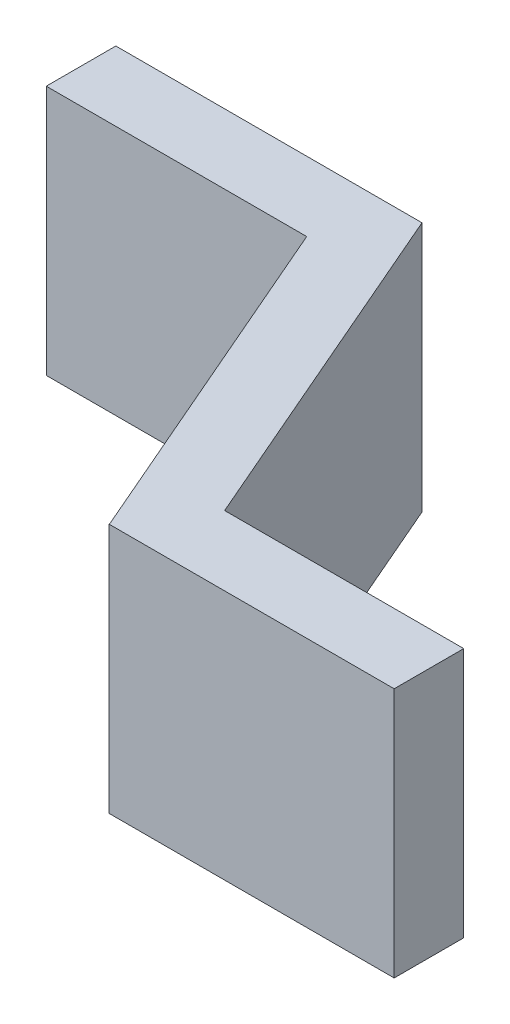
ISO-10303-21;
HEADER;
FILE_DESCRIPTION(('STEP AP214'),'2;1');
FILE_NAME('part.step','',(''),(''),'','','');
FILE_SCHEMA(('AUTOMOTIVE_DESIGN { 1 0 10303 214 1 1 1 1 }'));
ENDSEC;
DATA;
#1=APPLICATION_CONTEXT('core data for automotive mechanical design processes');
#2=APPLICATION_PROTOCOL_DEFINITION('international standard','automotive_design',2000,#1);
#3=PRODUCT_CONTEXT('',#1,'mechanical');
#4=PRODUCT('Part','Part','',(#3));
#5=PRODUCT_RELATED_PRODUCT_CATEGORY('part','',(#4));
#6=PRODUCT_DEFINITION_FORMATION('','',#4);
#7=PRODUCT_DEFINITION_CONTEXT('part definition',#1,'design');
#8=PRODUCT_DEFINITION('design','',#6,#7);
#9=PRODUCT_DEFINITION_SHAPE('','',#8);
#10=(LENGTH_UNIT() NAMED_UNIT(*) SI_UNIT(.MILLI.,.METRE.));
#11=(NAMED_UNIT(*) PLANE_ANGLE_UNIT() SI_UNIT($,.RADIAN.));
#12=(NAMED_UNIT(*) SI_UNIT($,.STERADIAN.) SOLID_ANGLE_UNIT());
#13=UNCERTAINTY_MEASURE_WITH_UNIT(LENGTH_MEASURE(1.E-05),#10,'distance_accuracy_value','');
#14=(GEOMETRIC_REPRESENTATION_CONTEXT(3) GLOBAL_UNCERTAINTY_ASSIGNED_CONTEXT((#13)) GLOBAL_UNIT_ASSIGNED_CONTEXT((#10,
#11,#12)) REPRESENTATION_CONTEXT('',''));
#15=CARTESIAN_POINT('',(0.,0.,0.));
#16=DIRECTION('',(0.,0.,1.));
#17=DIRECTION('',(1.,0.,0.));
#18=AXIS2_PLACEMENT_3D('',#15,#16,#17);
#19=CARTESIAN_POINT('',(0.,2.62,0.));
#20=DIRECTION('',(1.,0.,0.));
#21=DIRECTION('',(0.,0.,-1.));
#22=AXIS2_PLACEMENT_3D('',#19,#20,#21);
#23=PLANE('',#22);
#24=DIRECTION('',(0.,1.,0.));
#25=VECTOR('',#24,1.);
#26=CARTESIAN_POINT('',(0.,2.62,0.));
#27=LINE('',#26,#25);
#28=CARTESIAN_POINT('',(0.,2.980000014305,-1.30339419427667E-10));
#29=VERTEX_POINT('',#28);
#30=CARTESIAN_POINT('',(0.,2.62,-1.556831963824E-10));
#31=VERTEX_POINT('',#30);
#32=EDGE_CURVE('E123',#29,#31,#27,.F.);
#33=ORIENTED_EDGE('',*,*,#32,.T.);
#34=DIRECTION('',(0.,0.,1.));
#35=VECTOR('',#34,1.);
#36=CARTESIAN_POINT('',(0.,2.62,0.));
#37=LINE('',#36,#35);
#38=CARTESIAN_POINT('',(0.,2.62,0.10000000149));
#39=VERTEX_POINT('',#38);
#40=EDGE_CURVE('E115',#31,#39,#37,.T.);
#41=ORIENTED_EDGE('',*,*,#40,.T.);
#42=DIRECTION('',(0.,1.,0.));
#43=VECTOR('',#42,1.);
#44=CARTESIAN_POINT('',(0.,2.62,0.10000000149));
#45=LINE('',#44,#43);
#46=CARTESIAN_POINT('',(0.,2.980000014305,0.10000000149));
#47=VERTEX_POINT('',#46);
#48=EDGE_CURVE('E134',#47,#39,#45,.F.);
#49=ORIENTED_EDGE('',*,*,#48,.F.);
#50=DIRECTION('',(0.,0.,1.));
#51=VECTOR('',#50,1.);
#52=CARTESIAN_POINT('',(0.,2.980000014305,0.));
#53=LINE('',#52,#51);
#54=EDGE_CURVE('E140',#29,#47,#53,.T.);
#55=ORIENTED_EDGE('',*,*,#54,.F.);
#56=EDGE_LOOP('',(#33,#41,#49,#55));
#57=FACE_BOUND('',#56,.T.);
#58=ADVANCED_FACE('F17',(#57),#23,.F.);
#59=CARTESIAN_POINT('',(0.,2.62,0.10000000149));
#60=DIRECTION('',(0.,0.,1.));
#61=DIRECTION('',(1.,0.,0.));
#62=AXIS2_PLACEMENT_3D('',#59,#60,#61);
#63=PLANE('',#62);
#64=DIRECTION('',(0.,1.,0.));
#65=VECTOR('',#64,1.);
#66=CARTESIAN_POINT('',(0.374312226605181,2.62,0.100000001489922));
#67=LINE('',#66,#65);
#68=CARTESIAN_POINT('',(0.37431222660506,2.980000014305,0.100000001489974));
#69=VERTEX_POINT('',#68);
#70=CARTESIAN_POINT('',(0.374312226605091,2.62,0.100000001489974));
#71=VERTEX_POINT('',#70);
#72=EDGE_CURVE('E132',#69,#71,#67,.F.);
#73=ORIENTED_EDGE('',*,*,#72,.F.);
#74=DIRECTION('',(1.,0.,0.));
#75=VECTOR('',#74,1.);
#76=CARTESIAN_POINT('',(0.44,2.980000014305,0.10000000149));
#77=LINE('',#76,#75);
#78=EDGE_CURVE('E137',#47,#69,#77,.T.);
#79=ORIENTED_EDGE('',*,*,#78,.F.);
#80=ORIENTED_EDGE('',*,*,#48,.T.);
#81=DIRECTION('',(1.,0.,0.));
#82=VECTOR('',#81,1.);
#83=CARTESIAN_POINT('',(0.44,2.62,0.10000000149));
#84=LINE('',#83,#82);
#85=EDGE_CURVE('E111',#39,#71,#84,.T.);
#86=ORIENTED_EDGE('',*,*,#85,.T.);
#87=EDGE_LOOP('',(#73,#79,#80,#86));
#88=FACE_BOUND('',#87,.T.);
#89=ADVANCED_FACE('F214',(#88),#63,.T.);
#90=CARTESIAN_POINT('',(0.348224508223,2.62,0.03971472531736));
#91=DIRECTION('',(-0.917754904098641,0.,0.397147247255844));
#92=DIRECTION('',(0.397147247255844,0.,0.917754904098641));
#93=AXIS2_PLACEMENT_3D('',#90,#91,#92);
#94=PLANE('',#93);
#95=DIRECTION('',(0.397147247255413,0.,0.917754904098827));
#96=VECTOR('',#95,1.);
#97=CARTESIAN_POINT('',(0.374312226605,2.62,0.10000000149));
#98=LINE('',#97,#96);
#99=CARTESIAN_POINT('',(0.59,2.62,0.59842599627));
#100=VERTEX_POINT('',#99);
#101=EDGE_CURVE('E110',#71,#100,#98,.T.);
#102=ORIENTED_EDGE('',*,*,#101,.T.);
#103=DIRECTION('',(0.,1.,0.));
#104=VECTOR('',#103,1.);
#105=CARTESIAN_POINT('',(0.59,2.62,0.59842599627));
#106=LINE('',#105,#104);
#107=CARTESIAN_POINT('',(0.59,2.980000014305,0.59842599627));
#108=VERTEX_POINT('',#107);
#109=EDGE_CURVE('E86',#100,#108,#106,.T.);
#110=ORIENTED_EDGE('',*,*,#109,.T.);
#111=DIRECTION('',(0.397147247255413,0.,0.917754904098827));
#112=VECTOR('',#111,1.);
#113=CARTESIAN_POINT('',(0.374312226605,2.980000014305,0.10000000149));
#114=LINE('',#113,#112);
#115=EDGE_CURVE('E139',#69,#108,#114,.T.);
#116=ORIENTED_EDGE('',*,*,#115,.F.);
#117=ORIENTED_EDGE('',*,*,#72,.T.);
#118=EDGE_LOOP('',(#102,#110,#116,#117));
#119=FACE_BOUND('',#118,.T.);
#120=ADVANCED_FACE('F215',(#119),#94,.T.);
#121=CARTESIAN_POINT('',(0.59,2.62,0.5));
#122=DIRECTION('',(1.,0.,0.));
#123=DIRECTION('',(0.,0.,-1.));
#124=AXIS2_PLACEMENT_3D('',#121,#122,#123);
#125=PLANE('',#124);
#126=ORIENTED_EDGE('',*,*,#109,.F.);
#127=DIRECTION('',(0.,0.,-1.));
#128=VECTOR('',#127,1.);
#129=CARTESIAN_POINT('',(0.59,2.62,0.5));
#130=LINE('',#129,#128);
#131=CARTESIAN_POINT('',(0.59,2.62,0.60000000149));
#132=VERTEX_POINT('',#131);
#133=EDGE_CURVE('E20',#100,#132,#130,.F.);
#134=ORIENTED_EDGE('',*,*,#133,.T.);
#135=DIRECTION('',(0.,1.,0.));
#136=VECTOR('',#135,1.);
#137=CARTESIAN_POINT('',(0.59,2.62,0.60000000149));
#138=LINE('',#137,#136);
#139=CARTESIAN_POINT('',(0.59,2.980000014305,0.60000000149));
#140=VERTEX_POINT('',#139);
#141=EDGE_CURVE('E93',#140,#132,#138,.F.);
#142=ORIENTED_EDGE('',*,*,#141,.F.);
#143=DIRECTION('',(0.,0.,1.));
#144=VECTOR('',#143,1.);
#145=CARTESIAN_POINT('',(0.59,2.980000014305,0.));
#146=LINE('',#145,#144);
#147=EDGE_CURVE('E182',#108,#140,#146,.T.);
#148=ORIENTED_EDGE('',*,*,#147,.F.);
#149=EDGE_LOOP('',(#126,#134,#142,#148));
#150=FACE_BOUND('',#149,.T.);
#151=ADVANCED_FACE('F109',(#150),#125,.F.);
#152=CARTESIAN_POINT('',(0.59,2.62,0.60000000149));
#153=DIRECTION('',(0.,0.,1.));
#154=DIRECTION('',(1.,0.,0.));
#155=AXIS2_PLACEMENT_3D('',#152,#153,#154);
#156=PLANE('',#155);
#157=ORIENTED_EDGE('',*,*,#141,.T.);
#158=DIRECTION('',(1.,0.,0.));
#159=VECTOR('',#158,1.);
#160=CARTESIAN_POINT('',(0.44,2.62,0.60000000149));
#161=LINE('',#160,#159);
#162=CARTESIAN_POINT('',(0.999999996424,2.62,0.60000000149));
#163=VERTEX_POINT('',#162);
#164=EDGE_CURVE('E97',#132,#163,#161,.T.);
#165=ORIENTED_EDGE('',*,*,#164,.T.);
#166=DIRECTION('',(0.,1.,0.));
#167=VECTOR('',#166,1.);
#168=CARTESIAN_POINT('',(0.999999996424,2.62,0.60000000149));
#169=LINE('',#168,#167);
#170=CARTESIAN_POINT('',(0.999999996424,2.980000014305,0.60000000149));
#171=VERTEX_POINT('',#170);
#172=EDGE_CURVE('E99',#171,#163,#169,.F.);
#173=ORIENTED_EDGE('',*,*,#172,.F.);
#174=DIRECTION('',(1.,0.,0.));
#175=VECTOR('',#174,1.);
#176=CARTESIAN_POINT('',(0.44,2.980000014305,0.60000000149));
#177=LINE('',#176,#175);
#178=EDGE_CURVE('E98',#140,#171,#177,.T.);
#179=ORIENTED_EDGE('',*,*,#178,.F.);
#180=EDGE_LOOP('',(#157,#165,#173,#179));
#181=FACE_BOUND('',#180,.T.);
#182=ADVANCED_FACE('F95',(#181),#156,.T.);
#183=CARTESIAN_POINT('',(0.999999996424,2.62,0.5));
#184=DIRECTION('',(1.,0.,0.));
#185=DIRECTION('',(0.,0.,-1.));
#186=AXIS2_PLACEMENT_3D('',#183,#184,#185);
#187=PLANE('',#186);
#188=DIRECTION('',(0.,0.,1.));
#189=VECTOR('',#188,1.);
#190=CARTESIAN_POINT('',(0.999999996424,2.62,0.));
#191=LINE('',#190,#189);
#192=CARTESIAN_POINT('',(0.999999996424,2.62,0.5));
#193=VERTEX_POINT('',#192);
#194=EDGE_CURVE('E107',#163,#193,#191,.F.);
#195=ORIENTED_EDGE('',*,*,#194,.T.);
#196=DIRECTION('',(0.,1.,0.));
#197=VECTOR('',#196,1.);
#198=CARTESIAN_POINT('',(0.999999996424,2.62,0.5));
#199=LINE('',#198,#197);
#200=CARTESIAN_POINT('',(0.999999996424,2.980000014305,0.5));
#201=VERTEX_POINT('',#200);
#202=EDGE_CURVE('E192',#193,#201,#199,.T.);
#203=ORIENTED_EDGE('',*,*,#202,.T.);
#204=DIRECTION('',(0.,0.,1.));
#205=VECTOR('',#204,1.);
#206=CARTESIAN_POINT('',(0.999999996424,2.980000014305,0.));
#207=LINE('',#206,#205);
#208=EDGE_CURVE('E126',#171,#201,#207,.F.);
#209=ORIENTED_EDGE('',*,*,#208,.F.);
#210=ORIENTED_EDGE('',*,*,#172,.T.);
#211=EDGE_LOOP('',(#195,#203,#209,#210));
#212=FACE_BOUND('',#211,.T.);
#213=ADVANCED_FACE('F238',(#212),#187,.T.);
#214=CARTESIAN_POINT('',(0.,2.62,0.));
#215=DIRECTION('',(0.,0.,1.));
#216=DIRECTION('',(1.,0.,0.));
#217=AXIS2_PLACEMENT_3D('',#214,#215,#216);
#218=PLANE('',#217);
#219=DIRECTION('',(1.,0.,0.));
#220=VECTOR('',#219,1.);
#221=CARTESIAN_POINT('',(0.44,2.62,-2.335247945736E-10));
#222=LINE('',#221,#220);
#223=CARTESIAN_POINT('',(0.439999999656335,2.62,-3.43069646239979E-10));
#224=VERTEX_POINT('',#223);
#225=EDGE_CURVE('E155',#224,#31,#222,.F.);
#226=ORIENTED_EDGE('',*,*,#225,.T.);
#227=ORIENTED_EDGE('',*,*,#32,.F.);
#228=DIRECTION('',(1.,0.,0.));
#229=VECTOR('',#228,1.);
#230=CARTESIAN_POINT('',(0.44,2.980000014305,-1.955091291415E-10));
#231=LINE('',#230,#229);
#232=CARTESIAN_POINT('',(0.439999999458534,2.980000014305,-1.955091291415E-10));
#233=VERTEX_POINT('',#232);
#234=EDGE_CURVE('E147',#233,#29,#231,.F.);
#235=ORIENTED_EDGE('',*,*,#234,.F.);
#236=DIRECTION('',(0.,1.,0.));
#237=VECTOR('',#236,1.);
#238=CARTESIAN_POINT('',(0.439999999804137,2.62,-4.52614497906357E-10));
#239=LINE('',#238,#237);
#240=EDGE_CURVE('E128',#233,#224,#239,.F.);
#241=ORIENTED_EDGE('',*,*,#240,.T.);
#242=EDGE_LOOP('',(#226,#227,#235,#241));
#243=FACE_BOUND('',#242,.T.);
#244=ADVANCED_FACE('F235',(#243),#218,.F.);
#245=CARTESIAN_POINT('',(0.44,2.62,0.));
#246=DIRECTION('',(0.,1.,0.));
#247=DIRECTION('',(0.,0.,1.));
#248=AXIS2_PLACEMENT_3D('',#245,#246,#247);
#249=PLANE('',#248);
#250=DIRECTION('',(1.,0.,0.));
#251=VECTOR('',#250,1.);
#252=CARTESIAN_POINT('',(0.59,2.62,0.5));
#253=LINE('',#252,#251);
#254=CARTESIAN_POINT('',(0.656368904967001,2.62,0.499999999999999));
#255=VERTEX_POINT('',#254);
#256=EDGE_CURVE('E166',#255,#193,#253,.T.);
#257=ORIENTED_EDGE('',*,*,#256,.T.);
#258=ORIENTED_EDGE('',*,*,#194,.F.);
#259=ORIENTED_EDGE('',*,*,#164,.F.);
#260=ORIENTED_EDGE('',*,*,#133,.F.);
#261=ORIENTED_EDGE('',*,*,#101,.F.);
#262=ORIENTED_EDGE('',*,*,#85,.F.);
#263=ORIENTED_EDGE('',*,*,#40,.F.);
#264=ORIENTED_EDGE('',*,*,#225,.F.);
#265=DIRECTION('',(0.397147247255844,0.,0.917754904098641));
#266=VECTOR('',#265,1.);
#267=CARTESIAN_POINT('',(0.44,2.62,0.));
#268=LINE('',#267,#266);
#269=EDGE_CURVE('E160',#224,#255,#268,.T.);
#270=ORIENTED_EDGE('',*,*,#269,.T.);
#271=EDGE_LOOP('',(#257,#258,#259,#260,#261,#262,#263,#264,#270));
#272=FACE_BOUND('',#271,.T.);
#273=ADVANCED_FACE('F104',(#272),#249,.F.);
#274=CARTESIAN_POINT('',(0.59,2.62,0.5));
#275=DIRECTION('',(0.,0.,1.));
#276=DIRECTION('',(1.,0.,0.));
#277=AXIS2_PLACEMENT_3D('',#274,#275,#276);
#278=PLANE('',#277);
#279=ORIENTED_EDGE('',*,*,#256,.F.);
#280=DIRECTION('',(0.,1.,0.));
#281=VECTOR('',#280,1.);
#282=CARTESIAN_POINT('',(0.656368904967005,2.62,0.499999999999998));
#283=LINE('',#282,#281);
#284=CARTESIAN_POINT('',(0.656368904967001,2.980000014305,0.499999999999999));
#285=VERTEX_POINT('',#284);
#286=EDGE_CURVE('E26',#255,#285,#283,.T.);
#287=ORIENTED_EDGE('',*,*,#286,.T.);
#288=DIRECTION('',(1.,0.,0.));
#289=VECTOR('',#288,1.);
#290=CARTESIAN_POINT('',(0.44,2.980000014305,0.5));
#291=LINE('',#290,#289);
#292=EDGE_CURVE('E34',#201,#285,#291,.F.);
#293=ORIENTED_EDGE('',*,*,#292,.F.);
#294=ORIENTED_EDGE('',*,*,#202,.F.);
#295=EDGE_LOOP('',(#279,#287,#293,#294));
#296=FACE_BOUND('',#295,.T.);
#297=ADVANCED_FACE('F199',(#296),#278,.F.);
#298=CARTESIAN_POINT('',(0.44,2.980000014305,0.));
#299=DIRECTION('',(0.,1.,0.));
#300=DIRECTION('',(0.,0.,1.));
#301=AXIS2_PLACEMENT_3D('',#298,#299,#300);
#302=PLANE('',#301);
#303=ORIENTED_EDGE('',*,*,#178,.T.);
#304=ORIENTED_EDGE('',*,*,#208,.T.);
#305=ORIENTED_EDGE('',*,*,#292,.T.);
#306=DIRECTION('',(0.397147247255844,0.,0.917754904098641));
#307=VECTOR('',#306,1.);
#308=CARTESIAN_POINT('',(0.44,2.980000014305,0.));
#309=LINE('',#308,#307);
#310=EDGE_CURVE('E11',#285,#233,#309,.F.);
#311=ORIENTED_EDGE('',*,*,#310,.T.);
#312=ORIENTED_EDGE('',*,*,#234,.T.);
#313=ORIENTED_EDGE('',*,*,#54,.T.);
#314=ORIENTED_EDGE('',*,*,#78,.T.);
#315=ORIENTED_EDGE('',*,*,#115,.T.);
#316=ORIENTED_EDGE('',*,*,#147,.T.);
#317=EDGE_LOOP('',(#303,#304,#305,#311,#312,#313,#314,#315,#316));
#318=FACE_BOUND('',#317,.T.);
#319=ADVANCED_FACE('F204',(#318),#302,.T.);
#320=CARTESIAN_POINT('',(0.44,2.62,0.));
#321=DIRECTION('',(-0.917754904098641,0.,0.397147247255844));
#322=DIRECTION('',(0.397147247255844,0.,0.917754904098641));
#323=AXIS2_PLACEMENT_3D('',#320,#321,#322);
#324=PLANE('',#323);
#325=ORIENTED_EDGE('',*,*,#286,.F.);
#326=ORIENTED_EDGE('',*,*,#269,.F.);
#327=ORIENTED_EDGE('',*,*,#240,.F.);
#328=ORIENTED_EDGE('',*,*,#310,.F.);
#329=EDGE_LOOP('',(#325,#326,#327,#328));
#330=FACE_BOUND('',#329,.T.);
#331=ADVANCED_FACE('F201',(#330),#324,.F.);
#332=CLOSED_SHELL('',(#58,#89,#120,#151,#182,#213,#244,#273,#297,#319,#331));
#333=MANIFOLD_SOLID_BREP('B1',#332);
#334=ADVANCED_BREP_SHAPE_REPRESENTATION('',(#18,#333),#14);
#335=SHAPE_DEFINITION_REPRESENTATION(#9,#334);
ENDSEC;
END-ISO-10303-21;
